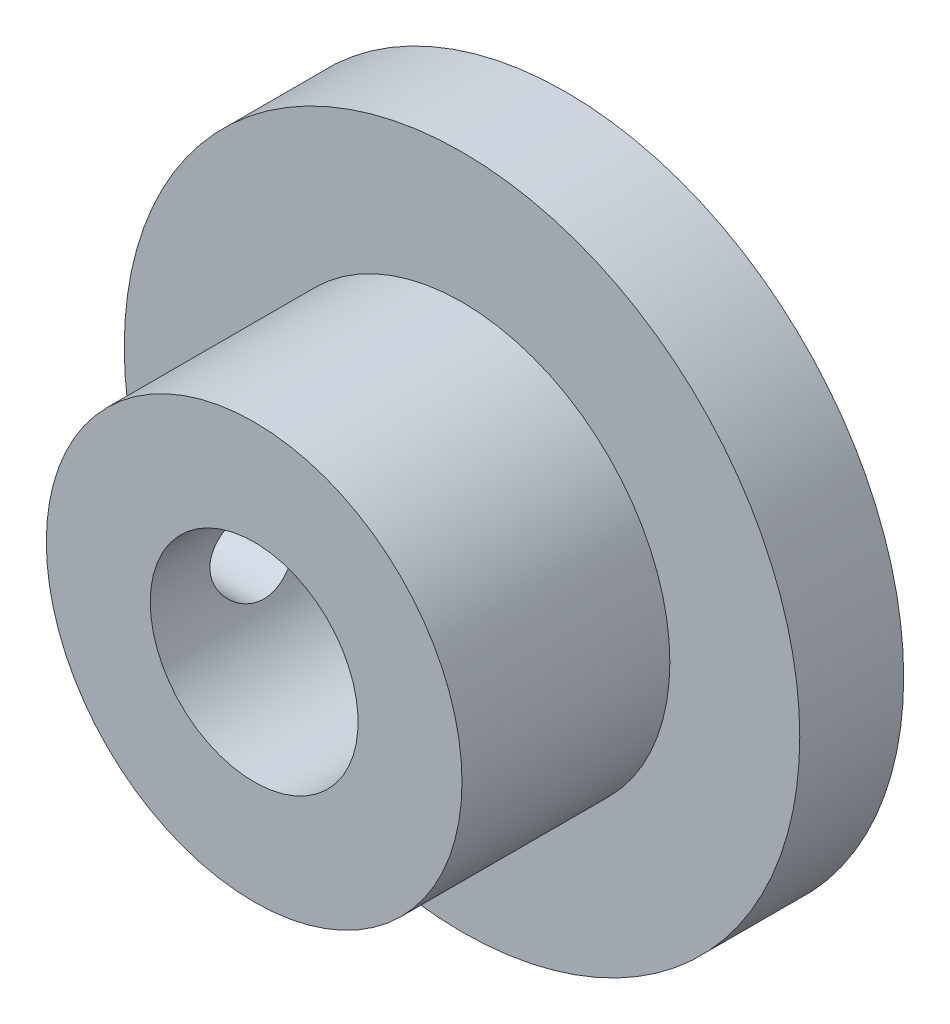
ISO-10303-21;
HEADER;
FILE_DESCRIPTION(('STEP AP214'),'2;1');
FILE_NAME('part.step','',(''),(''),'','','');
FILE_SCHEMA(('AUTOMOTIVE_DESIGN { 1 0 10303 214 1 1 1 1 }'));
ENDSEC;
DATA;
#1=APPLICATION_CONTEXT('core data for automotive mechanical design processes');
#2=APPLICATION_PROTOCOL_DEFINITION('international standard','automotive_design',2000,#1);
#3=PRODUCT_CONTEXT('',#1,'mechanical');
#4=PRODUCT('Part','Part','',(#3));
#5=PRODUCT_RELATED_PRODUCT_CATEGORY('part','',(#4));
#6=PRODUCT_DEFINITION_FORMATION('','',#4);
#7=PRODUCT_DEFINITION_CONTEXT('part definition',#1,'design');
#8=PRODUCT_DEFINITION('design','',#6,#7);
#9=PRODUCT_DEFINITION_SHAPE('','',#8);
#10=(LENGTH_UNIT() NAMED_UNIT(*) SI_UNIT(.MILLI.,.METRE.));
#11=(NAMED_UNIT(*) PLANE_ANGLE_UNIT() SI_UNIT($,.RADIAN.));
#12=(NAMED_UNIT(*) SI_UNIT($,.STERADIAN.) SOLID_ANGLE_UNIT());
#13=UNCERTAINTY_MEASURE_WITH_UNIT(LENGTH_MEASURE(1.E-05),#10,'distance_accuracy_value','');
#14=(GEOMETRIC_REPRESENTATION_CONTEXT(3) GLOBAL_UNCERTAINTY_ASSIGNED_CONTEXT((#13)) GLOBAL_UNIT_ASSIGNED_CONTEXT((#10,
#11,#12)) REPRESENTATION_CONTEXT('',''));
#15=CARTESIAN_POINT('',(0.,0.,0.));
#16=DIRECTION('',(0.,0.,1.));
#17=DIRECTION('',(1.,0.,0.));
#18=AXIS2_PLACEMENT_3D('',#15,#16,#17);
#19=CARTESIAN_POINT('',(0.,0.,3.175));
#20=DIRECTION('',(0.,0.,-1.));
#21=DIRECTION('',(-1.,0.,0.));
#22=AXIS2_PLACEMENT_3D('',#19,#20,#21);
#23=CYLINDRICAL_SURFACE('',#22,10.31875);
#24=CARTESIAN_POINT('',(0.,0.,3.175));
#25=DIRECTION('',(0.,0.,1.));
#26=DIRECTION('',(1.,0.,0.));
#27=AXIS2_PLACEMENT_3D('',#24,#25,#26);
#28=CIRCLE('',#27,10.31875);
#29=CARTESIAN_POINT('',(10.31875,0.,3.175));
#30=VERTEX_POINT('',#29);
#31=EDGE_CURVE('E41',#30,#30,#28,.T.);
#32=ORIENTED_EDGE('',*,*,#31,.F.);
#33=EDGE_LOOP('',(#32));
#34=FACE_BOUND('',#33,.T.);
#35=CARTESIAN_POINT('',(0.,0.,0.));
#36=DIRECTION('',(0.,0.,1.));
#37=DIRECTION('',(1.,0.,0.));
#38=AXIS2_PLACEMENT_3D('',#35,#36,#37);
#39=CIRCLE('',#38,10.31875);
#40=CARTESIAN_POINT('',(10.31875,0.,0.));
#41=VERTEX_POINT('',#40);
#42=EDGE_CURVE('E37',#41,#41,#39,.T.);
#43=ORIENTED_EDGE('',*,*,#42,.T.);
#44=EDGE_LOOP('',(#43));
#45=FACE_BOUND('',#44,.T.);
#46=ADVANCED_FACE('F34',(#34,#45),#23,.T.);
#47=CARTESIAN_POINT('',(0.,0.,3.175));
#48=DIRECTION('',(0.,0.,1.));
#49=DIRECTION('',(1.,0.,0.));
#50=AXIS2_PLACEMENT_3D('',#47,#48,#49);
#51=PLANE('',#50);
#52=CARTESIAN_POINT('',(0.,0.,3.175));
#53=DIRECTION('',(0.,0.,1.));
#54=DIRECTION('',(1.,0.,0.));
#55=AXIS2_PLACEMENT_3D('',#52,#53,#54);
#56=CIRCLE('',#55,6.35);
#57=CARTESIAN_POINT('',(6.35,0.,3.175));
#58=VERTEX_POINT('',#57);
#59=EDGE_CURVE('E10',#58,#58,#56,.T.);
#60=ORIENTED_EDGE('',*,*,#59,.F.);
#61=EDGE_LOOP('',(#60));
#62=FACE_BOUND('',#61,.T.);
#63=ORIENTED_EDGE('',*,*,#31,.T.);
#64=EDGE_LOOP('',(#63));
#65=FACE_BOUND('',#64,.T.);
#66=ADVANCED_FACE('F93',(#62,#65),#51,.T.);
#67=CARTESIAN_POINT('',(0.,0.,0.));
#68=DIRECTION('',(0.,0.,1.));
#69=DIRECTION('',(1.,0.,0.));
#70=AXIS2_PLACEMENT_3D('',#67,#68,#69);
#71=PLANE('',#70);
#72=CARTESIAN_POINT('',(0.,0.,0.));
#73=DIRECTION('',(0.,0.,-1.));
#74=DIRECTION('',(-1.,0.,0.));
#75=AXIS2_PLACEMENT_3D('',#72,#73,#74);
#76=CIRCLE('',#75,3.175);
#77=CARTESIAN_POINT('',(-3.175,0.,0.));
#78=VERTEX_POINT('',#77);
#79=EDGE_CURVE('E51',#78,#78,#76,.T.);
#80=ORIENTED_EDGE('',*,*,#79,.F.);
#81=EDGE_LOOP('',(#80));
#82=FACE_BOUND('',#81,.T.);
#83=ORIENTED_EDGE('',*,*,#42,.F.);
#84=EDGE_LOOP('',(#83));
#85=FACE_BOUND('',#84,.T.);
#86=ADVANCED_FACE('F89',(#82,#85),#71,.F.);
#87=CARTESIAN_POINT('',(0.,0.,9.525));
#88=DIRECTION('',(0.,0.,-1.));
#89=DIRECTION('',(-1.,0.,0.));
#90=AXIS2_PLACEMENT_3D('',#87,#88,#89);
#91=CYLINDRICAL_SURFACE('',#90,6.35);
#92=CARTESIAN_POINT('',(-6.35,0.,7.70255));
#93=CARTESIAN_POINT('',(-6.34999861096237,-0.0750646140818434,7.70254737073417));
#94=CARTESIAN_POINT('',(-6.34865540088408,-0.150161450028055,7.69627992657758));
#95=CARTESIAN_POINT('',(-6.34342675076644,-0.298225296339674,7.67139984164008));
#96=CARTESIAN_POINT('',(-6.33953943023363,-0.371190689529797,7.65277806894851));
#97=CARTESIAN_POINT('',(-6.32965577699744,-0.512830125656907,7.603796439198));
#98=CARTESIAN_POINT('',(-6.32366159067733,-0.581508452531715,7.57344852510907));
#99=CARTESIAN_POINT('',(-6.31021261659612,-0.712795420037444,7.5019132358319));
#100=CARTESIAN_POINT('',(-6.30275788196482,-0.77540428133116,7.46072625491349));
#101=CARTESIAN_POINT('',(-6.28707845908267,-0.893733729529972,7.36801641240627));
#102=CARTESIAN_POINT('',(-6.27884463503177,-0.949348399501572,7.31635989745548));
#103=CARTESIAN_POINT('',(-6.26260005999281,-1.05119276861777,7.20446437873646));
#104=CARTESIAN_POINT('',(-6.25458932813968,-1.09742166485733,7.14422464146688));
#105=CARTESIAN_POINT('',(-6.23960815322762,-1.17964434517394,7.01609621196687));
#106=CARTESIAN_POINT('',(-6.23264943245589,-1.21552634219632,6.94813429098301));
#107=CARTESIAN_POINT('',(-6.22069088315544,-1.27531989778063,6.80697282167515));
#108=CARTESIAN_POINT('',(-6.21569083337163,-1.29923280847738,6.73377386604163));
#109=CARTESIAN_POINT('',(-6.20830861045501,-1.33406128746238,6.58536223184559));
#110=CARTESIAN_POINT('',(-6.20588881195717,-1.34516385912344,6.51019534927045));
#111=CARTESIAN_POINT('',(-6.20382799290792,-1.35463777151121,6.35902984251258));
#112=CARTESIAN_POINT('',(-6.20418664902391,-1.35301059361624,6.28303131613722));
#113=CARTESIAN_POINT('',(-6.20760811333917,-1.33722190727113,6.13374306124383));
#114=CARTESIAN_POINT('',(-6.2106242486392,-1.32327672735781,6.06042922291285));
#115=CARTESIAN_POINT('',(-6.21894713261562,-1.28359022137343,5.91720610345467));
#116=CARTESIAN_POINT('',(-6.22425400382448,-1.25784826428298,5.84729700467113));
#117=CARTESIAN_POINT('',(-6.23660694361686,-1.19509780651165,5.71225487729554));
#118=CARTESIAN_POINT('',(-6.24366590013669,-1.15800532064544,5.64716210229017));
#119=CARTESIAN_POINT('',(-6.25871962533893,-1.07366584098501,5.52404430904634));
#120=CARTESIAN_POINT('',(-6.2667145152598,-1.02641753096658,5.46602020845719));
#121=CARTESIAN_POINT('',(-6.2829401548711,-0.921958343447951,5.35744048769627));
#122=CARTESIAN_POINT('',(-6.29117238219288,-0.864563295807785,5.30706210282791));
#123=CARTESIAN_POINT('',(-6.30679580872777,-0.742047254963459,5.21661794179964));
#124=CARTESIAN_POINT('',(-6.31418699419339,-0.676926135506122,5.17655233419665));
#125=CARTESIAN_POINT('',(-6.32731762757995,-0.540596304673301,5.10783073935462));
#126=CARTESIAN_POINT('',(-6.3330538427319,-0.46937602644303,5.07919704156644));
#127=CARTESIAN_POINT('',(-6.34220404917476,-0.322985870928896,5.03435198574641));
#128=CARTESIAN_POINT('',(-6.34561836032497,-0.247816539193657,5.01813891664289));
#129=CARTESIAN_POINT('',(-6.34969483950221,-0.0971831975907133,4.99885097050666));
#130=CARTESIAN_POINT('',(-6.35040774522148,-0.021751538849418,4.99553385095834));
#131=CARTESIAN_POINT('',(-6.34914287490065,0.128588082469587,5.00147669974056));
#132=CARTESIAN_POINT('',(-6.34716527145521,0.203496078330147,5.01073586130961));
#133=CARTESIAN_POINT('',(-6.34077352324428,0.349866034457528,5.04136743385906));
#134=CARTESIAN_POINT('',(-6.33638477329703,0.421355609891958,5.06261365582203));
#135=CARTESIAN_POINT('',(-6.32566160887462,0.559756726901239,5.11647686686692));
#136=CARTESIAN_POINT('',(-6.319327034669,0.626667892088092,5.14909478946832));
#137=CARTESIAN_POINT('',(-6.30528928586048,0.755020804805225,5.22528628571363));
#138=CARTESIAN_POINT('',(-6.29756861532476,0.816375459390216,5.2690032828613));
#139=CARTESIAN_POINT('',(-6.28165242253472,0.930964829041667,5.3659621104687));
#140=CARTESIAN_POINT('',(-6.2734568420981,0.984198546279221,5.4192051096557));
#141=CARTESIAN_POINT('',(-6.2573405892671,1.08198553722146,5.53481349998989));
#142=CARTESIAN_POINT('',(-6.2494271894923,1.1263715051453,5.59732160373991));
#143=CARTESIAN_POINT('',(-6.23493483661359,1.20401575994887,5.72904773091926));
#144=CARTESIAN_POINT('',(-6.22835582689793,1.23727451894147,5.79826546950683));
#145=CARTESIAN_POINT('',(-6.21733781696005,1.29150180342355,5.94108031915002));
#146=CARTESIAN_POINT('',(-6.21288706126121,1.31253798284658,6.01465079056798));
#147=CARTESIAN_POINT('',(-6.2066070485769,1.34192355845653,6.16438861944233));
#148=CARTESIAN_POINT('',(-6.20477739714954,1.35027486356241,6.24055558439385));
#149=CARTESIAN_POINT('',(-6.20397068907972,1.35397567572369,6.39163973219357));
#150=CARTESIAN_POINT('',(-6.20493549674238,1.34959015346798,6.46655023703136));
#151=CARTESIAN_POINT('',(-6.2094780181016,1.32853178134123,6.61453887630111));
#152=CARTESIAN_POINT('',(-6.21305570424062,1.31185906106091,6.68761703005012));
#153=CARTESIAN_POINT('',(-6.22239325528924,1.26682455867663,6.82966923948335));
#154=CARTESIAN_POINT('',(-6.22814627217719,1.23849943440763,6.89865539651984));
#155=CARTESIAN_POINT('',(-6.24118930990987,1.17099639387991,7.03093635025732));
#156=CARTESIAN_POINT('',(-6.24847948123034,1.13181741499343,7.09423058889684));
#157=CARTESIAN_POINT('',(-6.26395040356261,1.04283172893201,7.21464141782745));
#158=CARTESIAN_POINT('',(-6.27214556837561,0.992835380639869,7.27161603459636));
#159=CARTESIAN_POINT('',(-6.2884042122436,0.884020822113278,7.37645398581748));
#160=CARTESIAN_POINT('',(-6.29646766049922,0.825200580420685,7.42431521639077));
#161=CARTESIAN_POINT('',(-6.31167047796941,0.699546337421047,7.51012290218367));
#162=CARTESIAN_POINT('',(-6.31879741398043,0.632623562218123,7.54794167619793));
#163=CARTESIAN_POINT('',(-6.33120028356375,0.493235348200113,7.61173467200623));
#164=CARTESIAN_POINT('',(-6.33647780542986,0.420774730811315,7.63771906305292));
#165=CARTESIAN_POINT('',(-6.34361905124058,0.2901768273112,7.67234743478013));
#166=CARTESIAN_POINT('',(-6.34599734619059,0.232758269670466,7.68365224038747));
#167=CARTESIAN_POINT('',(-6.34918833005957,0.11689962831609,7.69875439627315));
#168=CARTESIAN_POINT('',(-6.35000108176889,0.0584595856667479,7.70255204764645));
#169=CARTESIAN_POINT('',(-6.35,0.,7.70255));
#170=B_SPLINE_CURVE_WITH_KNOTS('',3,(#92,#93,#94,#95,#96,#97,#98,#99,#100,#101,#102,#103,#104,
#105,#106,#107,#108,#109,#110,#111,#112,#113,#114,#115,#116,#117,#118,#119,#120,#121,#122,#123,
#124,#125,#126,#127,#128,#129,#130,#131,#132,#133,#134,#135,#136,#137,#138,#139,#140,#141,#142,
#143,#144,#145,#146,#147,#148,#149,#150,#151,#152,#153,#154,#155,#156,#157,#158,#159,#160,#161,
#162,#163,#164,#165,#166,#167,#168,#169),.UNSPECIFIED.,.T.,.F.,(4,2,2,2,2,2,2,2,2,2,2,2,2,2,2,2,
2,2,2,2,2,2,2,2,2,2,2,2,2,2,2,2,2,2,2,2,2,2,4),(0.,0.224979895980791,0.450126275209805,
0.67504394674997,0.899953438065847,1.12793886928433,1.355943795283,1.58632693132888,
1.81668403536191,2.04363409247308,2.27055773948938,2.4935736737059,2.71660153862233,
2.94132126356155,3.16607013040717,3.39542056996826,3.62477475790389,3.85457397221981,
4.08434152359174,4.3097715649296,4.53518714573762,4.75827288077634,4.98137693356216,
5.20752538847284,5.43370160816211,5.66381649384172,5.89392161481026,6.12274062574887,
6.35152519880278,6.57558456164184,6.79964156140387,7.02299901575426,7.24637834526044,
7.47404733340155,7.70176881671732,7.93226022587937,8.16255319898055,8.33777236451397,
8.51298450226032),.UNSPECIFIED.);
#171=CARTESIAN_POINT('',(-6.35,0.,7.70255));
#172=VERTEX_POINT('',#171);
#173=EDGE_CURVE('E54',#172,#172,#170,.T.);
#174=ORIENTED_EDGE('',*,*,#173,.T.);
#175=EDGE_LOOP('',(#174));
#176=FACE_BOUND('',#175,.T.);
#177=CARTESIAN_POINT('',(0.,0.,9.525));
#178=DIRECTION('',(0.,0.,1.));
#179=DIRECTION('',(1.,0.,0.));
#180=AXIS2_PLACEMENT_3D('',#177,#178,#179);
#181=CIRCLE('',#180,6.35);
#182=CARTESIAN_POINT('',(6.35,0.,9.525));
#183=VERTEX_POINT('',#182);
#184=EDGE_CURVE('E47',#183,#183,#181,.T.);
#185=ORIENTED_EDGE('',*,*,#184,.F.);
#186=EDGE_LOOP('',(#185));
#187=FACE_BOUND('',#186,.T.);
#188=ORIENTED_EDGE('',*,*,#59,.T.);
#189=EDGE_LOOP('',(#188));
#190=FACE_BOUND('',#189,.T.);
#191=ADVANCED_FACE('F69',(#176,#187,#190),#91,.T.);
#192=CARTESIAN_POINT('',(0.,0.,9.525));
#193=DIRECTION('',(0.,0.,1.));
#194=DIRECTION('',(1.,0.,0.));
#195=AXIS2_PLACEMENT_3D('',#192,#193,#194);
#196=PLANE('',#195);
#197=CARTESIAN_POINT('',(0.,0.,9.525));
#198=DIRECTION('',(0.,0.,-1.));
#199=DIRECTION('',(-1.,0.,0.));
#200=AXIS2_PLACEMENT_3D('',#197,#198,#199);
#201=CIRCLE('',#200,3.175);
#202=CARTESIAN_POINT('',(-3.175,0.,9.525));
#203=VERTEX_POINT('',#202);
#204=EDGE_CURVE('E50',#203,#203,#201,.T.);
#205=ORIENTED_EDGE('',*,*,#204,.T.);
#206=EDGE_LOOP('',(#205));
#207=FACE_BOUND('',#206,.T.);
#208=ORIENTED_EDGE('',*,*,#184,.T.);
#209=EDGE_LOOP('',(#208));
#210=FACE_BOUND('',#209,.T.);
#211=ADVANCED_FACE('F82',(#207,#210),#196,.T.);
#212=CARTESIAN_POINT('',(0.,0.,9.525));
#213=DIRECTION('',(0.,0.,-1.));
#214=DIRECTION('',(-1.,0.,0.));
#215=AXIS2_PLACEMENT_3D('',#212,#213,#214);
#216=CYLINDRICAL_SURFACE('',#215,3.175);
#217=CARTESIAN_POINT('',(-3.175,0.,7.70255));
#218=CARTESIAN_POINT('',(-3.1749937642741,0.0723119803182968,7.70254177520316));
#219=CARTESIAN_POINT('',(-3.17250122265995,0.144730355969441,7.69671677085275));
#220=CARTESIAN_POINT('',(-3.16277066799621,0.287508253069319,7.67362700946327));
#221=CARTESIAN_POINT('',(-3.15552058505164,0.357862061157262,7.65633315473188));
#222=CARTESIAN_POINT('',(-3.13705242394937,0.494208939922366,7.61106652134826));
#223=CARTESIAN_POINT('',(-3.12584804282756,0.560216141686439,7.58313057893921));
#224=CARTESIAN_POINT('',(-3.1005551810215,0.686540807637017,7.51752831329107));
#225=CARTESIAN_POINT('',(-3.0864675019097,0.746859846370328,7.47986469363826));
#226=CARTESIAN_POINT('',(-3.05599084668588,0.863330621553543,7.3938105223501));
#227=CARTESIAN_POINT('',(-3.03952431771545,0.919148042993752,7.34499522263455));
#228=CARTESIAN_POINT('',(-3.00647271455961,1.02209379973983,7.23892253623825));
#229=CARTESIAN_POINT('',(-2.98988758046311,1.06921736595388,7.18166054685898));
#230=CARTESIAN_POINT('',(-2.95750917471473,1.15586188650404,7.05671614571851));
#231=CARTESIAN_POINT('',(-2.94180185247632,1.19486044876668,6.98864683913289));
#232=CARTESIAN_POINT('',(-2.91419493098839,1.26070499788386,6.84615021576441));
#233=CARTESIAN_POINT('',(-2.90229328389849,1.28755752377759,6.77172634579415));
#234=CARTESIAN_POINT('',(-2.88448854081883,1.32695137173236,6.62248178209826));
#235=CARTESIAN_POINT('',(-2.87831670118836,1.34013766580825,6.54786466649272));
#236=CARTESIAN_POINT('',(-2.87190163928982,1.35383505668087,6.39724141107698));
#237=CARTESIAN_POINT('',(-2.87165493063134,1.35435360727363,6.32123611443425));
#238=CARTESIAN_POINT('',(-2.87689162283199,1.34318495882507,6.17655646216194));
#239=CARTESIAN_POINT('',(-2.88191351336426,1.3324808719224,6.10778608927004));
#240=CARTESIAN_POINT('',(-2.89633861211708,1.30082548820464,5.97313102087289));
#241=CARTESIAN_POINT('',(-2.90574270501209,1.27987212223332,5.9072469109829));
#242=CARTESIAN_POINT('',(-2.92808748949866,1.22790087368373,5.77853272243311));
#243=CARTESIAN_POINT('',(-2.94110054344015,1.19667432188826,5.71580002824039));
#244=CARTESIAN_POINT('',(-2.96918199373291,1.12519137808888,5.59621377419416));
#245=CARTESIAN_POINT('',(-2.98425121955486,1.08493133768207,5.53936260333507));
#246=CARTESIAN_POINT('',(-3.01637253593642,0.9923339499282,5.42784411343625));
#247=CARTESIAN_POINT('',(-3.03348193205179,0.939241995039338,5.37381804789814));
#248=CARTESIAN_POINT('',(-3.06663259637418,0.824589839165174,5.27521552840121));
#249=CARTESIAN_POINT('',(-3.08267359069275,0.763027479068143,5.23064149115567));
#250=CARTESIAN_POINT('',(-3.11238486879188,0.63115799860415,5.15120918261834));
#251=CARTESIAN_POINT('',(-3.12598548270222,0.560670064560461,5.11662308137786));
#252=CARTESIAN_POINT('',(-3.14874388156016,0.414148596926306,5.06002704250685));
#253=CARTESIAN_POINT('',(-3.15790423558693,0.33811829944544,5.03800983135907));
#254=CARTESIAN_POINT('',(-3.17026332558042,0.188019452335297,5.00854491934094));
#255=CARTESIAN_POINT('',(-3.17381325962292,0.114148617869651,5.0002373446985));
#256=CARTESIAN_POINT('',(-3.17568105366636,-0.0340114282148159,4.99584992680004));
#257=CARTESIAN_POINT('',(-3.17400050350427,-0.108300505854283,4.99976636798234));
#258=CARTESIAN_POINT('',(-3.16582243599864,-0.251086365945456,5.01911043997587));
#259=CARTESIAN_POINT('',(-3.15958185757468,-0.319682718417006,5.03392433271249));
#260=CARTESIAN_POINT('',(-3.14319082038792,-0.453335115246511,5.07377756726435));
#261=CARTESIAN_POINT('',(-3.13303987341454,-0.518390716382746,5.09881818591264));
#262=CARTESIAN_POINT('',(-3.10940117061925,-0.645410792119004,5.15922832667114));
#263=CARTESIAN_POINT('',(-3.09581917390959,-0.707215459370454,5.19489577974538));
#264=CARTESIAN_POINT('',(-3.06675439613932,-0.824184879794796,5.27522103608394));
#265=CARTESIAN_POINT('',(-3.05127080824472,-0.879346794690438,5.31988266069994));
#266=CARTESIAN_POINT('',(-3.01863676563666,-0.985790778724581,5.42081760274854));
#267=CARTESIAN_POINT('',(-3.00144808863402,-1.03647723077649,5.47770827444718));
#268=CARTESIAN_POINT('',(-2.96835692538155,-1.12776122684815,5.59944302368866));
#269=CARTESIAN_POINT('',(-2.95245478278206,-1.16835608123138,5.66428921469234));
#270=CARTESIAN_POINT('',(-2.92358303045918,-1.23885812859457,5.80165757409286));
#271=CARTESIAN_POINT('',(-2.91066826625578,-1.26857052110254,5.87429211735658));
#272=CARTESIAN_POINT('',(-2.88995701757537,-1.31507928002952,6.02425935932626));
#273=CARTESIAN_POINT('',(-2.88215605454428,-1.3318869503345,6.10158788211573));
#274=CARTESIAN_POINT('',(-2.87326066425685,-1.35096216089002,6.2521089835159));
#275=CARTESIAN_POINT('',(-2.87168133184628,-1.35428166989025,6.32514007908179));
#276=CARTESIAN_POINT('',(-2.87410980516818,-1.34912066967993,6.47068163722144));
#277=CARTESIAN_POINT('',(-2.87811665484049,-1.34064217966592,6.54319218675054));
#278=CARTESIAN_POINT('',(-2.89081435572085,-1.31302255224126,6.68182444023977));
#279=CARTESIAN_POINT('',(-2.89925667251005,-1.29444551613291,6.74808352632024));
#280=CARTESIAN_POINT('',(-2.91966810669131,-1.24772175082134,6.87655240125548));
#281=CARTESIAN_POINT('',(-2.93163822413924,-1.21957230769734,6.93876103578051));
#282=CARTESIAN_POINT('',(-2.95866974170816,-1.15251036671548,7.06154945594293));
#283=CARTESIAN_POINT('',(-2.97387612153679,-1.1130417786036,7.12179297640017));
#284=CARTESIAN_POINT('',(-3.00528179589943,-1.02522167499385,7.23513050272946));
#285=CARTESIAN_POINT('',(-3.0214814577203,-0.976866860266104,7.28822184044812));
#286=CARTESIAN_POINT('',(-3.05455722211636,-0.868199860048702,7.38999082551859));
#287=CARTESIAN_POINT('',(-3.07138832065964,-0.807251096145338,7.43800664347723));
#288=CARTESIAN_POINT('',(-3.10257916482516,-0.677547032947666,7.52317457940271));
#289=CARTESIAN_POINT('',(-3.11693778833812,-0.60878821250422,7.56032177006529));
#290=CARTESIAN_POINT('',(-3.14138312017248,-0.466349244720165,7.62194468564941));
#291=CARTESIAN_POINT('',(-3.15153079407947,-0.392758601835344,7.64660247811649));
#292=CARTESIAN_POINT('',(-3.16665584269732,-0.24207828385414,7.68295039769719));
#293=CARTESIAN_POINT('',(-3.17164926980853,-0.165000257484025,7.69468079369904));
#294=CARTESIAN_POINT('',(-3.17459936321147,-0.0584013278768096,7.70160755828298));
#295=CARTESIAN_POINT('',(-3.17500251882829,-0.0292093438574405,7.70255332228377));
#296=CARTESIAN_POINT('',(-3.175,0.,7.70255));
#297=B_SPLINE_CURVE_WITH_KNOTS('',3,(#217,#218,#219,#220,#221,#222,#223,#224,#225,#226,#227,
#228,#229,#230,#231,#232,#233,#234,#235,#236,#237,#238,#239,#240,#241,#242,#243,#244,#245,#246,
#247,#248,#249,#250,#251,#252,#253,#254,#255,#256,#257,#258,#259,#260,#261,#262,#263,#264,#265,
#266,#267,#268,#269,#270,#271,#272,#273,#274,#275,#276,#277,#278,#279,#280,#281,#282,#283,#284,
#285,#286,#287,#288,#289,#290,#291,#292,#293,#294,#295,#296),.UNSPECIFIED.,.T.,.F.,(4,2,2,2,2,2,
2,2,2,2,2,2,2,2,2,2,2,2,2,2,2,2,2,2,2,2,2,2,2,2,2,2,2,2,2,2,2,2,2,4),(0.,0.216850050638944,
0.434252388523416,0.650908954368241,0.867505370130752,1.09439609589244,1.32141091689532,
1.56022386511507,1.79890809057365,2.02572902648839,2.25241649603317,2.46078251280768,
2.66919061253204,2.88212426261053,3.0951440666222,3.32706321416167,3.55904158793932,
3.79684693152949,4.03451451918156,4.25661426582137,4.47864651050859,4.68904802527597,
4.89947581724864,5.11647002970508,5.33355663169255,5.56682347195774,5.80015241655904,
6.03747459229678,6.27458864785546,6.49280702774581,6.71098806472671,6.91807492424947,
7.12522054501713,7.34512352029503,7.56510830550803,7.80215736760164,8.0393137302226,
8.27290548905711,8.50576753373726,8.59336087119996),.UNSPECIFIED.);
#298=CARTESIAN_POINT('',(-3.175,0.,7.70255));
#299=VERTEX_POINT('',#298);
#300=EDGE_CURVE('E64',#299,#299,#297,.T.);
#301=ORIENTED_EDGE('',*,*,#300,.T.);
#302=EDGE_LOOP('',(#301));
#303=FACE_BOUND('',#302,.T.);
#304=ORIENTED_EDGE('',*,*,#204,.F.);
#305=EDGE_LOOP('',(#304));
#306=FACE_BOUND('',#305,.T.);
#307=ORIENTED_EDGE('',*,*,#79,.T.);
#308=EDGE_LOOP('',(#307));
#309=FACE_BOUND('',#308,.T.);
#310=ADVANCED_FACE('F76',(#303,#306,#309),#216,.F.);
#311=CARTESIAN_POINT('',(-6.35,0.,6.35));
#312=DIRECTION('',(-1.,0.,0.));
#313=DIRECTION('',(0.,0.,1.));
#314=AXIS2_PLACEMENT_3D('',#311,#312,#313);
#315=CYLINDRICAL_SURFACE('',#314,1.35255);
#316=ORIENTED_EDGE('',*,*,#300,.F.);
#317=EDGE_LOOP('',(#316));
#318=FACE_BOUND('',#317,.T.);
#319=ORIENTED_EDGE('',*,*,#173,.F.);
#320=EDGE_LOOP('',(#319));
#321=FACE_BOUND('',#320,.T.);
#322=ADVANCED_FACE('F73',(#318,#321),#315,.F.);
#323=CLOSED_SHELL('',(#46,#66,#86,#191,#211,#310,#322));
#324=MANIFOLD_SOLID_BREP('B2',#323);
#325=ADVANCED_BREP_SHAPE_REPRESENTATION('',(#18,#324),#14);
#326=SHAPE_DEFINITION_REPRESENTATION(#9,#325);
ENDSEC;
END-ISO-10303-21;
